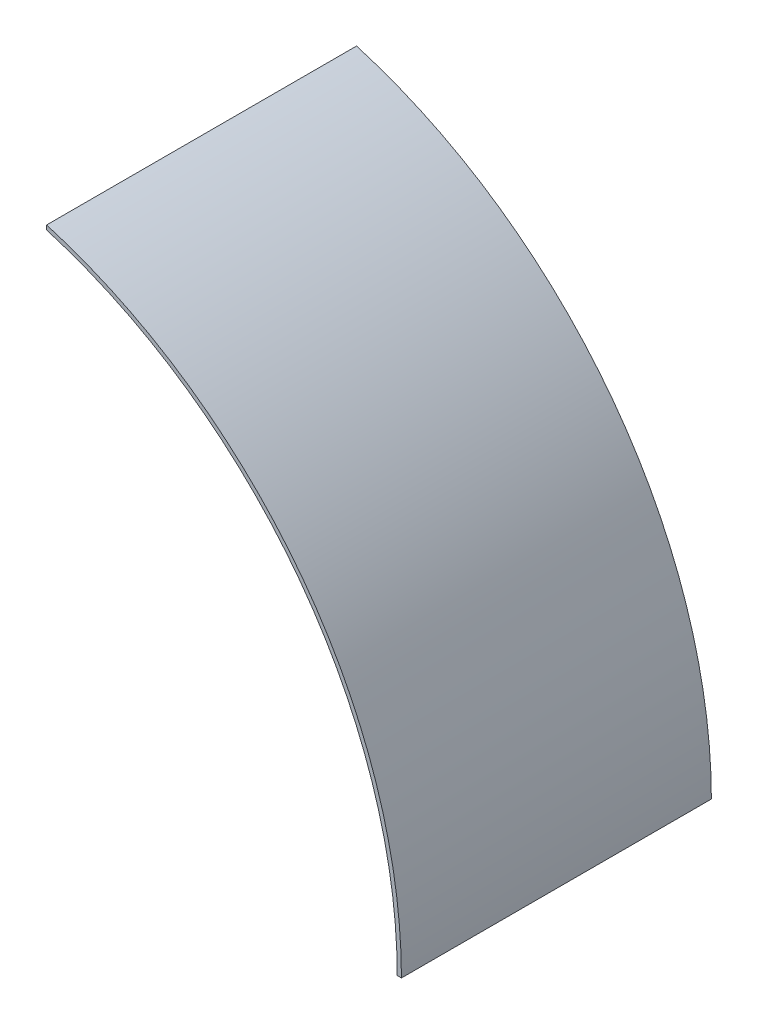
ISO-10303-21;
HEADER;
FILE_DESCRIPTION(('STEP AP214'),'2;1');
FILE_NAME('part.step','',(''),(''),'','','');
FILE_SCHEMA(('AUTOMOTIVE_DESIGN { 1 0 10303 214 1 1 1 1 }'));
ENDSEC;
DATA;
#1=APPLICATION_CONTEXT('core data for automotive mechanical design processes');
#2=APPLICATION_PROTOCOL_DEFINITION('international standard','automotive_design',2000,#1);
#3=PRODUCT_CONTEXT('',#1,'mechanical');
#4=PRODUCT('Part','Part','',(#3));
#5=PRODUCT_RELATED_PRODUCT_CATEGORY('part','',(#4));
#6=PRODUCT_DEFINITION_FORMATION('','',#4);
#7=PRODUCT_DEFINITION_CONTEXT('part definition',#1,'design');
#8=PRODUCT_DEFINITION('design','',#6,#7);
#9=PRODUCT_DEFINITION_SHAPE('','',#8);
#10=(LENGTH_UNIT() NAMED_UNIT(*) SI_UNIT(.MILLI.,.METRE.));
#11=(NAMED_UNIT(*) PLANE_ANGLE_UNIT() SI_UNIT($,.RADIAN.));
#12=(NAMED_UNIT(*) SI_UNIT($,.STERADIAN.) SOLID_ANGLE_UNIT());
#13=UNCERTAINTY_MEASURE_WITH_UNIT(LENGTH_MEASURE(1.E-05),#10,'distance_accuracy_value','');
#14=(GEOMETRIC_REPRESENTATION_CONTEXT(3) GLOBAL_UNCERTAINTY_ASSIGNED_CONTEXT((#13)) GLOBAL_UNIT_ASSIGNED_CONTEXT((#10,
#11,#12)) REPRESENTATION_CONTEXT('',''));
#15=CARTESIAN_POINT('',(0.,0.,0.));
#16=DIRECTION('',(0.,0.,1.));
#17=DIRECTION('',(1.,0.,0.));
#18=AXIS2_PLACEMENT_3D('',#15,#16,#17);
#19=CARTESIAN_POINT('',(0.,0.,112.268));
#20=DIRECTION('',(0.,0.,-1.));
#21=DIRECTION('',(-1.,0.,0.));
#22=AXIS2_PLACEMENT_3D('',#19,#20,#21);
#23=CYLINDRICAL_SURFACE('',#22,177.8);
#24=CARTESIAN_POINT('',(0.,0.,0.));
#25=DIRECTION('',(0.,0.,-1.));
#26=DIRECTION('',(-1.,0.,0.));
#27=AXIS2_PLACEMENT_3D('',#24,#25,#26);
#28=CIRCLE('',#27,177.8);
#29=CARTESIAN_POINT('',(50.8,170.388379885484,0.));
#30=VERTEX_POINT('',#29);
#31=CARTESIAN_POINT('',(177.8,0.,0.));
#32=VERTEX_POINT('',#31);
#33=EDGE_CURVE('E107',#30,#32,#28,.T.);
#34=ORIENTED_EDGE('',*,*,#33,.T.);
#35=DIRECTION('',(0.,0.,-1.));
#36=VECTOR('',#35,1.);
#37=CARTESIAN_POINT('',(177.8,0.,112.268));
#38=LINE('',#37,#36);
#39=CARTESIAN_POINT('',(177.8,0.,112.268));
#40=VERTEX_POINT('',#39);
#41=EDGE_CURVE('E11',#40,#32,#38,.T.);
#42=ORIENTED_EDGE('',*,*,#41,.F.);
#43=CARTESIAN_POINT('',(0.,0.,112.268));
#44=DIRECTION('',(0.,0.,-1.));
#45=DIRECTION('',(-1.,0.,0.));
#46=AXIS2_PLACEMENT_3D('',#43,#44,#45);
#47=CIRCLE('',#46,177.8);
#48=CARTESIAN_POINT('',(50.8,170.388379885484,112.268));
#49=VERTEX_POINT('',#48);
#50=EDGE_CURVE('E91',#49,#40,#47,.T.);
#51=ORIENTED_EDGE('',*,*,#50,.F.);
#52=DIRECTION('',(0.,0.,-1.));
#53=VECTOR('',#52,1.);
#54=CARTESIAN_POINT('',(50.8,170.388379885484,112.268));
#55=LINE('',#54,#53);
#56=EDGE_CURVE('E103',#49,#30,#55,.T.);
#57=ORIENTED_EDGE('',*,*,#56,.T.);
#58=EDGE_LOOP('',(#34,#42,#51,#57));
#59=FACE_BOUND('',#58,.T.);
#60=ADVANCED_FACE('F39',(#59),#23,.F.);
#61=CARTESIAN_POINT('',(177.8,0.,112.268));
#62=DIRECTION('',(0.,1.,0.));
#63=DIRECTION('',(0.,0.,1.));
#64=AXIS2_PLACEMENT_3D('',#61,#62,#63);
#65=PLANE('',#64);
#66=DIRECTION('',(1.,0.,0.));
#67=VECTOR('',#66,1.);
#68=CARTESIAN_POINT('',(177.8,0.,0.));
#69=LINE('',#68,#67);
#70=CARTESIAN_POINT('',(179.31892,0.,0.));
#71=VERTEX_POINT('',#70);
#72=EDGE_CURVE('E96',#32,#71,#69,.T.);
#73=ORIENTED_EDGE('',*,*,#72,.T.);
#74=DIRECTION('',(0.,0.,-1.));
#75=VECTOR('',#74,1.);
#76=CARTESIAN_POINT('',(179.31892,0.,112.268));
#77=LINE('',#76,#75);
#78=CARTESIAN_POINT('',(179.31892,0.,112.268));
#79=VERTEX_POINT('',#78);
#80=EDGE_CURVE('E48',#79,#71,#77,.T.);
#81=ORIENTED_EDGE('',*,*,#80,.F.);
#82=DIRECTION('',(1.,0.,0.));
#83=VECTOR('',#82,1.);
#84=CARTESIAN_POINT('',(177.8,0.,112.268));
#85=LINE('',#84,#83);
#86=EDGE_CURVE('E86',#40,#79,#85,.T.);
#87=ORIENTED_EDGE('',*,*,#86,.F.);
#88=ORIENTED_EDGE('',*,*,#41,.T.);
#89=EDGE_LOOP('',(#73,#81,#87,#88));
#90=FACE_BOUND('',#89,.T.);
#91=ADVANCED_FACE('F95',(#90),#65,.F.);
#92=CARTESIAN_POINT('',(0.,0.,112.268));
#93=DIRECTION('',(0.,0.,-1.));
#94=DIRECTION('',(-1.,0.,0.));
#95=AXIS2_PLACEMENT_3D('',#92,#93,#94);
#96=CYLINDRICAL_SURFACE('',#95,179.31892);
#97=CARTESIAN_POINT('',(0.,0.,0.));
#98=DIRECTION('',(0.,0.,1.));
#99=DIRECTION('',(1.,0.,0.));
#100=AXIS2_PLACEMENT_3D('',#97,#98,#99);
#101=CIRCLE('',#100,179.31892);
#102=CARTESIAN_POINT('',(50.8,171.972774211404,0.));
#103=VERTEX_POINT('',#102);
#104=EDGE_CURVE('E73',#71,#103,#101,.T.);
#105=ORIENTED_EDGE('',*,*,#104,.T.);
#106=DIRECTION('',(0.,0.,-1.));
#107=VECTOR('',#106,1.);
#108=CARTESIAN_POINT('',(50.8,171.972774211404,112.268));
#109=LINE('',#108,#107);
#110=CARTESIAN_POINT('',(50.8,171.972774211404,112.268));
#111=VERTEX_POINT('',#110);
#112=EDGE_CURVE('E98',#111,#103,#109,.T.);
#113=ORIENTED_EDGE('',*,*,#112,.F.);
#114=CARTESIAN_POINT('',(0.,0.,112.268));
#115=DIRECTION('',(0.,0.,1.));
#116=DIRECTION('',(1.,0.,0.));
#117=AXIS2_PLACEMENT_3D('',#114,#115,#116);
#118=CIRCLE('',#117,179.31892);
#119=EDGE_CURVE('E89',#79,#111,#118,.T.);
#120=ORIENTED_EDGE('',*,*,#119,.F.);
#121=ORIENTED_EDGE('',*,*,#80,.T.);
#122=EDGE_LOOP('',(#105,#113,#120,#121));
#123=FACE_BOUND('',#122,.T.);
#124=ADVANCED_FACE('F99',(#123),#96,.T.);
#125=CARTESIAN_POINT('',(50.8,171.972774211404,112.268));
#126=DIRECTION('',(1.,0.,0.));
#127=DIRECTION('',(0.,0.,-1.));
#128=AXIS2_PLACEMENT_3D('',#125,#126,#127);
#129=PLANE('',#128);
#130=DIRECTION('',(0.,-1.,0.));
#131=VECTOR('',#130,1.);
#132=CARTESIAN_POINT('',(50.8,171.972774211404,0.));
#133=LINE('',#132,#131);
#134=EDGE_CURVE('E79',#103,#30,#133,.T.);
#135=ORIENTED_EDGE('',*,*,#134,.T.);
#136=ORIENTED_EDGE('',*,*,#56,.F.);
#137=DIRECTION('',(0.,-1.,0.));
#138=VECTOR('',#137,1.);
#139=CARTESIAN_POINT('',(50.8,171.972774211404,112.268));
#140=LINE('',#139,#138);
#141=EDGE_CURVE('E56',#111,#49,#140,.T.);
#142=ORIENTED_EDGE('',*,*,#141,.F.);
#143=ORIENTED_EDGE('',*,*,#112,.T.);
#144=EDGE_LOOP('',(#135,#136,#142,#143));
#145=FACE_BOUND('',#144,.T.);
#146=ADVANCED_FACE('F120',(#145),#129,.F.);
#147=CARTESIAN_POINT('',(0.,0.,112.268));
#148=DIRECTION('',(0.,0.,-1.));
#149=DIRECTION('',(-1.,0.,0.));
#150=AXIS2_PLACEMENT_3D('',#147,#148,#149);
#151=PLANE('',#150);
#152=ORIENTED_EDGE('',*,*,#50,.T.);
#153=ORIENTED_EDGE('',*,*,#86,.T.);
#154=ORIENTED_EDGE('',*,*,#119,.T.);
#155=ORIENTED_EDGE('',*,*,#141,.T.);
#156=EDGE_LOOP('',(#152,#153,#154,#155));
#157=FACE_BOUND('',#156,.T.);
#158=ADVANCED_FACE('F87',(#157),#151,.F.);
#159=CARTESIAN_POINT('',(0.,0.,0.));
#160=DIRECTION('',(0.,0.,-1.));
#161=DIRECTION('',(-1.,0.,0.));
#162=AXIS2_PLACEMENT_3D('',#159,#160,#161);
#163=PLANE('',#162);
#164=ORIENTED_EDGE('',*,*,#33,.F.);
#165=ORIENTED_EDGE('',*,*,#134,.F.);
#166=ORIENTED_EDGE('',*,*,#104,.F.);
#167=ORIENTED_EDGE('',*,*,#72,.F.);
#168=EDGE_LOOP('',(#164,#165,#166,#167));
#169=FACE_BOUND('',#168,.T.);
#170=ADVANCED_FACE('F123',(#169),#163,.T.);
#171=CLOSED_SHELL('',(#60,#91,#124,#146,#158,#170));
#172=MANIFOLD_SOLID_BREP('B2',#171);
#173=ADVANCED_BREP_SHAPE_REPRESENTATION('',(#18,#172),#14);
#174=SHAPE_DEFINITION_REPRESENTATION(#9,#173);
ENDSEC;
END-ISO-10303-21;
